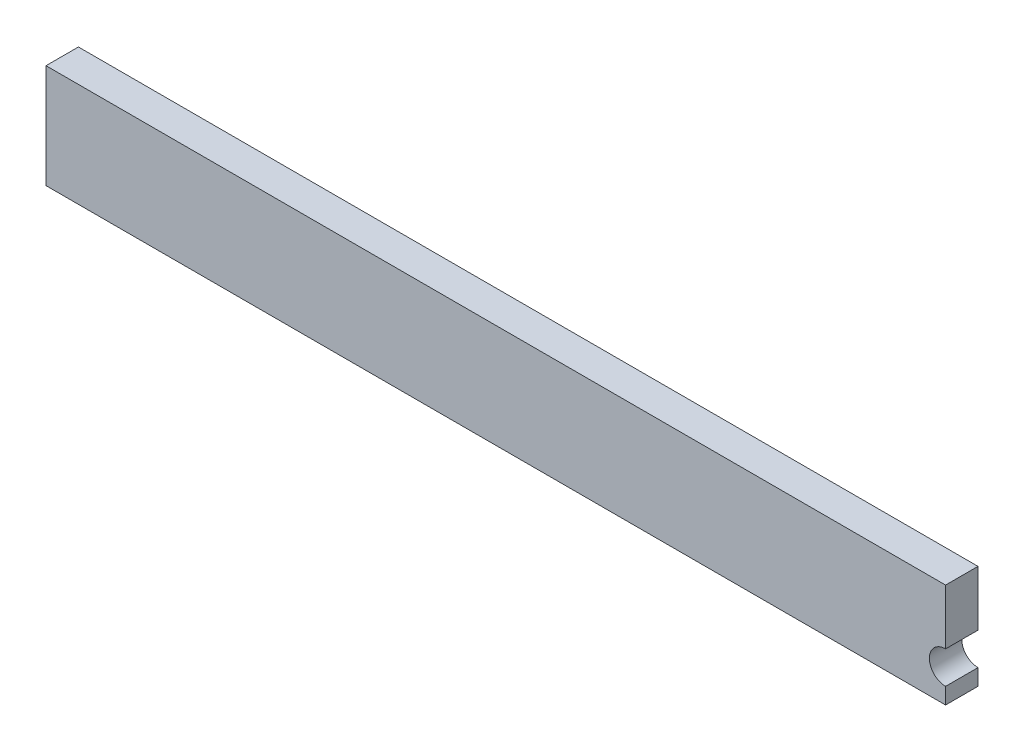
ISO-10303-21;
HEADER;
FILE_DESCRIPTION(('STEP AP214'),'2;1');
FILE_NAME('part.step','',(''),(''),'','','');
FILE_SCHEMA(('AUTOMOTIVE_DESIGN { 1 0 10303 214 1 1 1 1 }'));
ENDSEC;
DATA;
#1=APPLICATION_CONTEXT('core data for automotive mechanical design processes');
#2=APPLICATION_PROTOCOL_DEFINITION('international standard','automotive_design',2000,#1);
#3=PRODUCT_CONTEXT('',#1,'mechanical');
#4=PRODUCT('Part','Part','',(#3));
#5=PRODUCT_RELATED_PRODUCT_CATEGORY('part','',(#4));
#6=PRODUCT_DEFINITION_FORMATION('','',#4);
#7=PRODUCT_DEFINITION_CONTEXT('part definition',#1,'design');
#8=PRODUCT_DEFINITION('design','',#6,#7);
#9=PRODUCT_DEFINITION_SHAPE('','',#8);
#10=(LENGTH_UNIT() NAMED_UNIT(*) SI_UNIT(.MILLI.,.METRE.));
#11=(NAMED_UNIT(*) PLANE_ANGLE_UNIT() SI_UNIT($,.RADIAN.));
#12=(NAMED_UNIT(*) SI_UNIT($,.STERADIAN.) SOLID_ANGLE_UNIT());
#13=UNCERTAINTY_MEASURE_WITH_UNIT(LENGTH_MEASURE(1.E-05),#10,'distance_accuracy_value','');
#14=(GEOMETRIC_REPRESENTATION_CONTEXT(3) GLOBAL_UNCERTAINTY_ASSIGNED_CONTEXT((#13)) GLOBAL_UNIT_ASSIGNED_CONTEXT((#10,
#11,#12)) REPRESENTATION_CONTEXT('',''));
#15=CARTESIAN_POINT('',(0.,0.,0.));
#16=DIRECTION('',(0.,0.,1.));
#17=DIRECTION('',(1.,0.,0.));
#18=AXIS2_PLACEMENT_3D('',#15,#16,#17);
#19=CARTESIAN_POINT('',(55.5,2.,2.));
#20=DIRECTION('',(0.,0.,-1.));
#21=DIRECTION('',(-1.,0.,0.));
#22=AXIS2_PLACEMENT_3D('',#19,#20,#21);
#23=CYLINDRICAL_SURFACE('',#22,0.999999999999998);
#24=CARTESIAN_POINT('',(55.5,2.,0.));
#25=DIRECTION('',(0.,0.,1.));
#26=DIRECTION('',(1.,0.,0.));
#27=AXIS2_PLACEMENT_3D('',#24,#25,#26);
#28=CIRCLE('',#27,0.999999999999998);
#29=CARTESIAN_POINT('',(55.5,3.,0.));
#30=VERTEX_POINT('',#29);
#31=CARTESIAN_POINT('',(55.5,1.,0.));
#32=VERTEX_POINT('',#31);
#33=EDGE_CURVE('E116',#30,#32,#28,.T.);
#34=ORIENTED_EDGE('',*,*,#33,.F.);
#35=DIRECTION('',(0.,0.,-1.));
#36=VECTOR('',#35,1.);
#37=CARTESIAN_POINT('',(55.5,3.,2.));
#38=LINE('',#37,#36);
#39=CARTESIAN_POINT('',(55.5,3.,2.));
#40=VERTEX_POINT('',#39);
#41=EDGE_CURVE('E11',#40,#30,#38,.T.);
#42=ORIENTED_EDGE('',*,*,#41,.F.);
#43=CARTESIAN_POINT('',(55.5,2.,2.));
#44=DIRECTION('',(0.,0.,1.));
#45=DIRECTION('',(1.,0.,0.));
#46=AXIS2_PLACEMENT_3D('',#43,#44,#45);
#47=CIRCLE('',#46,0.999999999999998);
#48=CARTESIAN_POINT('',(55.5,1.,2.));
#49=VERTEX_POINT('',#48);
#50=EDGE_CURVE('E141',#40,#49,#47,.T.);
#51=ORIENTED_EDGE('',*,*,#50,.T.);
#52=DIRECTION('',(0.,0.,-1.));
#53=VECTOR('',#52,1.);
#54=CARTESIAN_POINT('',(55.5,1.,2.));
#55=LINE('',#54,#53);
#56=EDGE_CURVE('E79',#49,#32,#55,.T.);
#57=ORIENTED_EDGE('',*,*,#56,.T.);
#58=EDGE_LOOP('',(#34,#42,#51,#57));
#59=FACE_BOUND('',#58,.T.);
#60=ADVANCED_FACE('F35',(#59),#23,.F.);
#61=CARTESIAN_POINT('',(55.5,0.,2.));
#62=DIRECTION('',(-1.,0.,0.));
#63=DIRECTION('',(0.,0.,1.));
#64=AXIS2_PLACEMENT_3D('',#61,#62,#63);
#65=PLANE('',#64);
#66=DIRECTION('',(0.,1.,0.));
#67=VECTOR('',#66,1.);
#68=CARTESIAN_POINT('',(55.5,0.,0.));
#69=LINE('',#68,#67);
#70=CARTESIAN_POINT('',(55.5,6.41,0.));
#71=VERTEX_POINT('',#70);
#72=EDGE_CURVE('E119',#30,#71,#69,.T.);
#73=ORIENTED_EDGE('',*,*,#72,.T.);
#74=DIRECTION('',(0.,0.,-1.));
#75=VECTOR('',#74,1.);
#76=CARTESIAN_POINT('',(55.5,6.41,2.));
#77=LINE('',#76,#75);
#78=CARTESIAN_POINT('',(55.5,6.41,2.));
#79=VERTEX_POINT('',#78);
#80=EDGE_CURVE('E43',#79,#71,#77,.T.);
#81=ORIENTED_EDGE('',*,*,#80,.F.);
#82=DIRECTION('',(0.,1.,0.));
#83=VECTOR('',#82,1.);
#84=CARTESIAN_POINT('',(55.5,0.,2.));
#85=LINE('',#84,#83);
#86=EDGE_CURVE('E112',#40,#79,#85,.T.);
#87=ORIENTED_EDGE('',*,*,#86,.F.);
#88=ORIENTED_EDGE('',*,*,#41,.T.);
#89=EDGE_LOOP('',(#73,#81,#87,#88));
#90=FACE_BOUND('',#89,.T.);
#91=ADVANCED_FACE('F136',(#90),#65,.F.);
#92=CARTESIAN_POINT('',(0.,6.41,2.));
#93=DIRECTION('',(0.,1.,0.));
#94=DIRECTION('',(0.,0.,1.));
#95=AXIS2_PLACEMENT_3D('',#92,#93,#94);
#96=PLANE('',#95);
#97=DIRECTION('',(1.,0.,0.));
#98=VECTOR('',#97,1.);
#99=CARTESIAN_POINT('',(0.,6.41,0.));
#100=LINE('',#99,#98);
#101=CARTESIAN_POINT('',(0.,6.41,0.));
#102=VERTEX_POINT('',#101);
#103=EDGE_CURVE('E122',#102,#71,#100,.T.);
#104=ORIENTED_EDGE('',*,*,#103,.F.);
#105=DIRECTION('',(0.,0.,-1.));
#106=VECTOR('',#105,1.);
#107=CARTESIAN_POINT('',(0.,6.41,2.));
#108=LINE('',#107,#106);
#109=CARTESIAN_POINT('',(0.,6.41,2.));
#110=VERTEX_POINT('',#109);
#111=EDGE_CURVE('E101',#110,#102,#108,.T.);
#112=ORIENTED_EDGE('',*,*,#111,.F.);
#113=DIRECTION('',(1.,0.,0.));
#114=VECTOR('',#113,1.);
#115=CARTESIAN_POINT('',(0.,6.41,2.));
#116=LINE('',#115,#114);
#117=EDGE_CURVE('E110',#110,#79,#116,.T.);
#118=ORIENTED_EDGE('',*,*,#117,.T.);
#119=ORIENTED_EDGE('',*,*,#80,.T.);
#120=EDGE_LOOP('',(#104,#112,#118,#119));
#121=FACE_BOUND('',#120,.T.);
#122=ADVANCED_FACE('F133',(#121),#96,.T.);
#123=CARTESIAN_POINT('',(0.,0.,2.));
#124=DIRECTION('',(-1.,0.,0.));
#125=DIRECTION('',(0.,0.,1.));
#126=AXIS2_PLACEMENT_3D('',#123,#124,#125);
#127=PLANE('',#126);
#128=DIRECTION('',(0.,1.,0.));
#129=VECTOR('',#128,1.);
#130=CARTESIAN_POINT('',(0.,0.,0.));
#131=LINE('',#130,#129);
#132=CARTESIAN_POINT('',(0.,0.,0.));
#133=VERTEX_POINT('',#132);
#134=EDGE_CURVE('E100',#133,#102,#131,.T.);
#135=ORIENTED_EDGE('',*,*,#134,.F.);
#136=DIRECTION('',(0.,0.,-1.));
#137=VECTOR('',#136,1.);
#138=CARTESIAN_POINT('',(0.,0.,2.));
#139=LINE('',#138,#137);
#140=CARTESIAN_POINT('',(0.,0.,2.));
#141=VERTEX_POINT('',#140);
#142=EDGE_CURVE('E94',#141,#133,#139,.T.);
#143=ORIENTED_EDGE('',*,*,#142,.F.);
#144=DIRECTION('',(0.,1.,0.));
#145=VECTOR('',#144,1.);
#146=CARTESIAN_POINT('',(0.,0.,2.));
#147=LINE('',#146,#145);
#148=EDGE_CURVE('E98',#141,#110,#147,.T.);
#149=ORIENTED_EDGE('',*,*,#148,.T.);
#150=ORIENTED_EDGE('',*,*,#111,.T.);
#151=EDGE_LOOP('',(#135,#143,#149,#150));
#152=FACE_BOUND('',#151,.T.);
#153=ADVANCED_FACE('F96',(#152),#127,.T.);
#154=CARTESIAN_POINT('',(0.,0.,2.));
#155=DIRECTION('',(0.,1.,0.));
#156=DIRECTION('',(0.,0.,1.));
#157=AXIS2_PLACEMENT_3D('',#154,#155,#156);
#158=PLANE('',#157);
#159=DIRECTION('',(1.,0.,0.));
#160=VECTOR('',#159,1.);
#161=CARTESIAN_POINT('',(0.,0.,0.));
#162=LINE('',#161,#160);
#163=CARTESIAN_POINT('',(55.5,0.,0.));
#164=VERTEX_POINT('',#163);
#165=EDGE_CURVE('E72',#133,#164,#162,.T.);
#166=ORIENTED_EDGE('',*,*,#165,.T.);
#167=DIRECTION('',(0.,0.,-1.));
#168=VECTOR('',#167,1.);
#169=CARTESIAN_POINT('',(55.5,0.,2.));
#170=LINE('',#169,#168);
#171=CARTESIAN_POINT('',(55.5,0.,2.));
#172=VERTEX_POINT('',#171);
#173=EDGE_CURVE('E102',#172,#164,#170,.T.);
#174=ORIENTED_EDGE('',*,*,#173,.F.);
#175=DIRECTION('',(1.,0.,0.));
#176=VECTOR('',#175,1.);
#177=CARTESIAN_POINT('',(0.,0.,2.));
#178=LINE('',#177,#176);
#179=EDGE_CURVE('E104',#141,#172,#178,.T.);
#180=ORIENTED_EDGE('',*,*,#179,.F.);
#181=ORIENTED_EDGE('',*,*,#142,.T.);
#182=EDGE_LOOP('',(#166,#174,#180,#181));
#183=FACE_BOUND('',#182,.T.);
#184=ADVANCED_FACE('F105',(#183),#158,.F.);
#185=EDGE_CURVE('E123',#164,#32,#69,.T.);
#186=ORIENTED_EDGE('',*,*,#185,.T.);
#187=ORIENTED_EDGE('',*,*,#56,.F.);
#188=EDGE_CURVE('E51',#172,#49,#85,.T.);
#189=ORIENTED_EDGE('',*,*,#188,.F.);
#190=ORIENTED_EDGE('',*,*,#173,.T.);
#191=EDGE_LOOP('',(#186,#187,#189,#190));
#192=FACE_BOUND('',#191,.T.);
#193=ADVANCED_FACE('F148',(#192),#65,.F.);
#194=CARTESIAN_POINT('',(0.,0.,2.));
#195=DIRECTION('',(0.,0.,1.));
#196=DIRECTION('',(1.,0.,0.));
#197=AXIS2_PLACEMENT_3D('',#194,#195,#196);
#198=PLANE('',#197);
#199=ORIENTED_EDGE('',*,*,#50,.F.);
#200=ORIENTED_EDGE('',*,*,#86,.T.);
#201=ORIENTED_EDGE('',*,*,#117,.F.);
#202=ORIENTED_EDGE('',*,*,#148,.F.);
#203=ORIENTED_EDGE('',*,*,#179,.T.);
#204=ORIENTED_EDGE('',*,*,#188,.T.);
#205=EDGE_LOOP('',(#199,#200,#201,#202,#203,#204));
#206=FACE_BOUND('',#205,.T.);
#207=ADVANCED_FACE('F108',(#206),#198,.T.);
#208=CARTESIAN_POINT('',(0.,0.,0.));
#209=DIRECTION('',(0.,0.,1.));
#210=DIRECTION('',(1.,0.,0.));
#211=AXIS2_PLACEMENT_3D('',#208,#209,#210);
#212=PLANE('',#211);
#213=ORIENTED_EDGE('',*,*,#33,.T.);
#214=ORIENTED_EDGE('',*,*,#185,.F.);
#215=ORIENTED_EDGE('',*,*,#165,.F.);
#216=ORIENTED_EDGE('',*,*,#134,.T.);
#217=ORIENTED_EDGE('',*,*,#103,.T.);
#218=ORIENTED_EDGE('',*,*,#72,.F.);
#219=EDGE_LOOP('',(#213,#214,#215,#216,#217,#218));
#220=FACE_BOUND('',#219,.T.);
#221=ADVANCED_FACE('F138',(#220),#212,.F.);
#222=CLOSED_SHELL('',(#60,#91,#122,#153,#184,#193,#207,#221));
#223=MANIFOLD_SOLID_BREP('B2',#222);
#224=ADVANCED_BREP_SHAPE_REPRESENTATION('',(#18,#223),#14);
#225=SHAPE_DEFINITION_REPRESENTATION(#9,#224);
ENDSEC;
END-ISO-10303-21;
